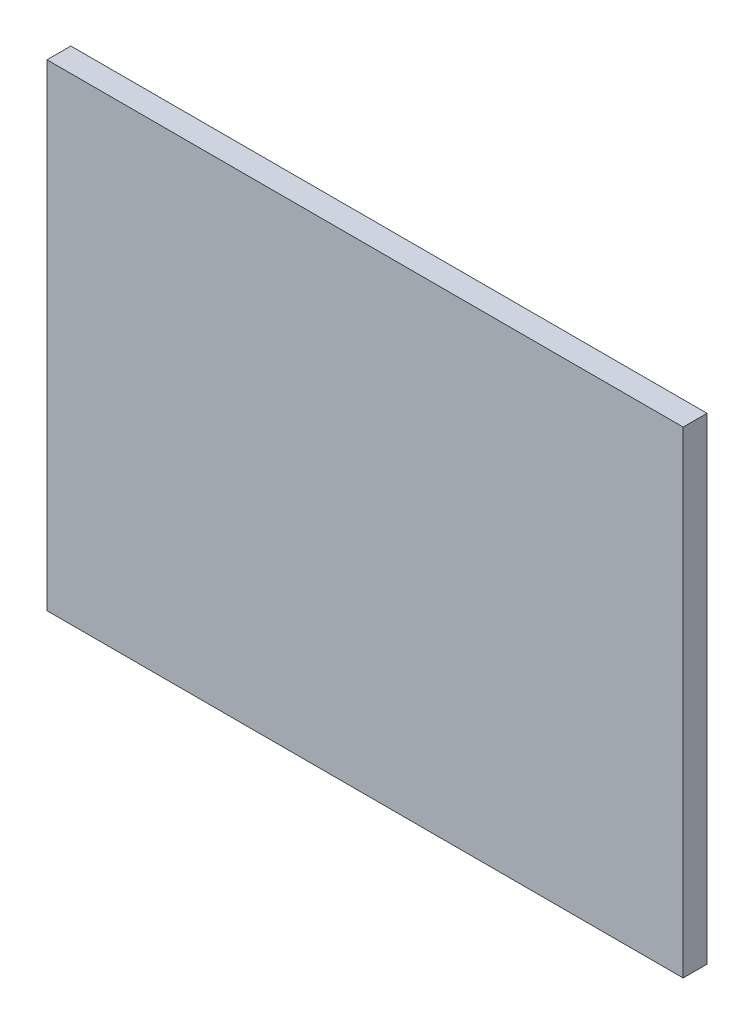
ISO-10303-21;
HEADER;
FILE_DESCRIPTION(('STEP AP214'),'2;1');
FILE_NAME('part.step','',(''),(''),'','','');
FILE_SCHEMA(('AUTOMOTIVE_DESIGN { 1 0 10303 214 1 1 1 1 }'));
ENDSEC;
DATA;
#1=APPLICATION_CONTEXT('core data for automotive mechanical design processes');
#2=APPLICATION_PROTOCOL_DEFINITION('international standard','automotive_design',2000,#1);
#3=PRODUCT_CONTEXT('',#1,'mechanical');
#4=PRODUCT('Part','Part','',(#3));
#5=PRODUCT_RELATED_PRODUCT_CATEGORY('part','',(#4));
#6=PRODUCT_DEFINITION_FORMATION('','',#4);
#7=PRODUCT_DEFINITION_CONTEXT('part definition',#1,'design');
#8=PRODUCT_DEFINITION('design','',#6,#7);
#9=PRODUCT_DEFINITION_SHAPE('','',#8);
#10=(LENGTH_UNIT() NAMED_UNIT(*) SI_UNIT(.MILLI.,.METRE.));
#11=(NAMED_UNIT(*) PLANE_ANGLE_UNIT() SI_UNIT($,.RADIAN.));
#12=(NAMED_UNIT(*) SI_UNIT($,.STERADIAN.) SOLID_ANGLE_UNIT());
#13=UNCERTAINTY_MEASURE_WITH_UNIT(LENGTH_MEASURE(1.E-05),#10,'distance_accuracy_value','');
#14=(GEOMETRIC_REPRESENTATION_CONTEXT(3) GLOBAL_UNCERTAINTY_ASSIGNED_CONTEXT((#13)) GLOBAL_UNIT_ASSIGNED_CONTEXT((#10,
#11,#12)) REPRESENTATION_CONTEXT('',''));
#15=CARTESIAN_POINT('',(0.,0.,0.));
#16=DIRECTION('',(0.,0.,1.));
#17=DIRECTION('',(1.,0.,0.));
#18=AXIS2_PLACEMENT_3D('',#15,#16,#17);
#19=CARTESIAN_POINT('',(50.8,-38.1,3.81));
#20=DIRECTION('',(-1.,0.,0.));
#21=DIRECTION('',(0.,0.,1.));
#22=AXIS2_PLACEMENT_3D('',#19,#20,#21);
#23=PLANE('',#22);
#24=DIRECTION('',(0.,1.,0.));
#25=VECTOR('',#24,1.);
#26=CARTESIAN_POINT('',(50.8,-38.1,0.));
#27=LINE('',#26,#25);
#28=CARTESIAN_POINT('',(50.8,-38.1,0.));
#29=VERTEX_POINT('',#28);
#30=CARTESIAN_POINT('',(50.8,38.1,0.));
#31=VERTEX_POINT('',#30);
#32=EDGE_CURVE('E96',#29,#31,#27,.T.);
#33=ORIENTED_EDGE('',*,*,#32,.T.);
#34=DIRECTION('',(0.,0.,-1.));
#35=VECTOR('',#34,1.);
#36=CARTESIAN_POINT('',(50.8,38.1,3.81));
#37=LINE('',#36,#35);
#38=CARTESIAN_POINT('',(50.8,38.1,3.81));
#39=VERTEX_POINT('',#38);
#40=EDGE_CURVE('E11',#39,#31,#37,.T.);
#41=ORIENTED_EDGE('',*,*,#40,.F.);
#42=DIRECTION('',(0.,1.,0.));
#43=VECTOR('',#42,1.);
#44=CARTESIAN_POINT('',(50.8,-38.1,3.81));
#45=LINE('',#44,#43);
#46=CARTESIAN_POINT('',(50.8,-38.1,3.81));
#47=VERTEX_POINT('',#46);
#48=EDGE_CURVE('E84',#47,#39,#45,.T.);
#49=ORIENTED_EDGE('',*,*,#48,.F.);
#50=DIRECTION('',(0.,0.,-1.));
#51=VECTOR('',#50,1.);
#52=CARTESIAN_POINT('',(50.8,-38.1,3.81));
#53=LINE('',#52,#51);
#54=EDGE_CURVE('E92',#47,#29,#53,.T.);
#55=ORIENTED_EDGE('',*,*,#54,.T.);
#56=EDGE_LOOP('',(#33,#41,#49,#55));
#57=FACE_BOUND('',#56,.T.);
#58=ADVANCED_FACE('F33',(#57),#23,.F.);
#59=CARTESIAN_POINT('',(-50.8,38.1,3.81));
#60=DIRECTION('',(0.,-1.,0.));
#61=DIRECTION('',(0.,0.,-1.));
#62=AXIS2_PLACEMENT_3D('',#59,#60,#61);
#63=PLANE('',#62);
#64=DIRECTION('',(-1.,0.,0.));
#65=VECTOR('',#64,1.);
#66=CARTESIAN_POINT('',(-50.8,38.1,0.));
#67=LINE('',#66,#65);
#68=CARTESIAN_POINT('',(-50.8,38.1,0.));
#69=VERTEX_POINT('',#68);
#70=EDGE_CURVE('E88',#31,#69,#67,.T.);
#71=ORIENTED_EDGE('',*,*,#70,.T.);
#72=DIRECTION('',(0.,0.,-1.));
#73=VECTOR('',#72,1.);
#74=CARTESIAN_POINT('',(-50.8,38.1,3.81));
#75=LINE('',#74,#73);
#76=CARTESIAN_POINT('',(-50.8,38.1,3.81));
#77=VERTEX_POINT('',#76);
#78=EDGE_CURVE('E41',#77,#69,#75,.T.);
#79=ORIENTED_EDGE('',*,*,#78,.F.);
#80=DIRECTION('',(-1.,0.,0.));
#81=VECTOR('',#80,1.);
#82=CARTESIAN_POINT('',(-50.8,38.1,3.81));
#83=LINE('',#82,#81);
#84=EDGE_CURVE('E79',#39,#77,#83,.T.);
#85=ORIENTED_EDGE('',*,*,#84,.F.);
#86=ORIENTED_EDGE('',*,*,#40,.T.);
#87=EDGE_LOOP('',(#71,#79,#85,#86));
#88=FACE_BOUND('',#87,.T.);
#89=ADVANCED_FACE('F87',(#88),#63,.F.);
#90=CARTESIAN_POINT('',(-50.8,-38.1,3.81));
#91=DIRECTION('',(1.,0.,0.));
#92=DIRECTION('',(0.,0.,-1.));
#93=AXIS2_PLACEMENT_3D('',#90,#91,#92);
#94=PLANE('',#93);
#95=DIRECTION('',(0.,-1.,0.));
#96=VECTOR('',#95,1.);
#97=CARTESIAN_POINT('',(-50.8,-38.1,0.));
#98=LINE('',#97,#96);
#99=CARTESIAN_POINT('',(-50.8,-38.1,0.));
#100=VERTEX_POINT('',#99);
#101=EDGE_CURVE('E66',#69,#100,#98,.T.);
#102=ORIENTED_EDGE('',*,*,#101,.T.);
#103=DIRECTION('',(0.,0.,-1.));
#104=VECTOR('',#103,1.);
#105=CARTESIAN_POINT('',(-50.8,-38.1,3.81));
#106=LINE('',#105,#104);
#107=CARTESIAN_POINT('',(-50.8,-38.1,3.81));
#108=VERTEX_POINT('',#107);
#109=EDGE_CURVE('E89',#108,#100,#106,.T.);
#110=ORIENTED_EDGE('',*,*,#109,.F.);
#111=DIRECTION('',(0.,-1.,0.));
#112=VECTOR('',#111,1.);
#113=CARTESIAN_POINT('',(-50.8,-38.1,3.81));
#114=LINE('',#113,#112);
#115=EDGE_CURVE('E82',#77,#108,#114,.T.);
#116=ORIENTED_EDGE('',*,*,#115,.F.);
#117=ORIENTED_EDGE('',*,*,#78,.T.);
#118=EDGE_LOOP('',(#102,#110,#116,#117));
#119=FACE_BOUND('',#118,.T.);
#120=ADVANCED_FACE('F90',(#119),#94,.F.);
#121=CARTESIAN_POINT('',(-50.8,-38.1,3.81));
#122=DIRECTION('',(0.,1.,0.));
#123=DIRECTION('',(0.,0.,1.));
#124=AXIS2_PLACEMENT_3D('',#121,#122,#123);
#125=PLANE('',#124);
#126=DIRECTION('',(1.,0.,0.));
#127=VECTOR('',#126,1.);
#128=CARTESIAN_POINT('',(-50.8,-38.1,0.));
#129=LINE('',#128,#127);
#130=EDGE_CURVE('E72',#100,#29,#129,.T.);
#131=ORIENTED_EDGE('',*,*,#130,.T.);
#132=ORIENTED_EDGE('',*,*,#54,.F.);
#133=DIRECTION('',(1.,0.,0.));
#134=VECTOR('',#133,1.);
#135=CARTESIAN_POINT('',(-50.8,-38.1,3.81));
#136=LINE('',#135,#134);
#137=EDGE_CURVE('E49',#108,#47,#136,.T.);
#138=ORIENTED_EDGE('',*,*,#137,.F.);
#139=ORIENTED_EDGE('',*,*,#109,.T.);
#140=EDGE_LOOP('',(#131,#132,#138,#139));
#141=FACE_BOUND('',#140,.T.);
#142=ADVANCED_FACE('F103',(#141),#125,.F.);
#143=CARTESIAN_POINT('',(0.,0.,3.81));
#144=DIRECTION('',(0.,0.,-1.));
#145=DIRECTION('',(-1.,0.,0.));
#146=AXIS2_PLACEMENT_3D('',#143,#144,#145);
#147=PLANE('',#146);
#148=ORIENTED_EDGE('',*,*,#48,.T.);
#149=ORIENTED_EDGE('',*,*,#84,.T.);
#150=ORIENTED_EDGE('',*,*,#115,.T.);
#151=ORIENTED_EDGE('',*,*,#137,.T.);
#152=EDGE_LOOP('',(#148,#149,#150,#151));
#153=FACE_BOUND('',#152,.T.);
#154=ADVANCED_FACE('F80',(#153),#147,.F.);
#155=CARTESIAN_POINT('',(0.,0.,0.));
#156=DIRECTION('',(0.,0.,-1.));
#157=DIRECTION('',(-1.,0.,0.));
#158=AXIS2_PLACEMENT_3D('',#155,#156,#157);
#159=PLANE('',#158);
#160=ORIENTED_EDGE('',*,*,#32,.F.);
#161=ORIENTED_EDGE('',*,*,#130,.F.);
#162=ORIENTED_EDGE('',*,*,#101,.F.);
#163=ORIENTED_EDGE('',*,*,#70,.F.);
#164=EDGE_LOOP('',(#160,#161,#162,#163));
#165=FACE_BOUND('',#164,.T.);
#166=ADVANCED_FACE('F106',(#165),#159,.T.);
#167=CLOSED_SHELL('',(#58,#89,#120,#142,#154,#166));
#168=MANIFOLD_SOLID_BREP('B2',#167);
#169=ADVANCED_BREP_SHAPE_REPRESENTATION('',(#18,#168),#14);
#170=SHAPE_DEFINITION_REPRESENTATION(#9,#169);
ENDSEC;
END-ISO-10303-21;
